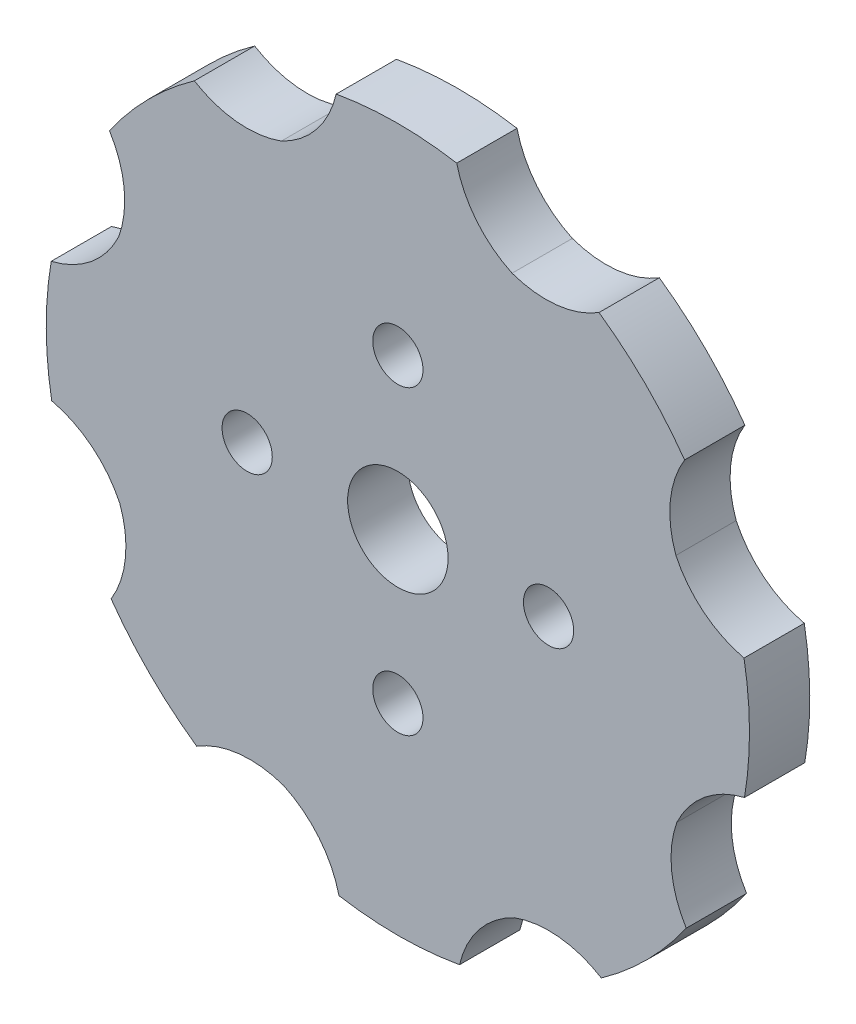
ISO-10303-21;
HEADER;
FILE_DESCRIPTION(('STEP AP214'),'2;1');
FILE_NAME('part.step','',(''),(''),'','','');
FILE_SCHEMA(('AUTOMOTIVE_DESIGN { 1 0 10303 214 1 1 1 1 }'));
ENDSEC;
DATA;
#1=APPLICATION_CONTEXT('core data for automotive mechanical design processes');
#2=APPLICATION_PROTOCOL_DEFINITION('international standard','automotive_design',2000,#1);
#3=PRODUCT_CONTEXT('',#1,'mechanical');
#4=PRODUCT('Part','Part','',(#3));
#5=PRODUCT_RELATED_PRODUCT_CATEGORY('part','',(#4));
#6=PRODUCT_DEFINITION_FORMATION('','',#4);
#7=PRODUCT_DEFINITION_CONTEXT('part definition',#1,'design');
#8=PRODUCT_DEFINITION('design','',#6,#7);
#9=PRODUCT_DEFINITION_SHAPE('','',#8);
#10=(LENGTH_UNIT() NAMED_UNIT(*) SI_UNIT(.MILLI.,.METRE.));
#11=(NAMED_UNIT(*) PLANE_ANGLE_UNIT() SI_UNIT($,.RADIAN.));
#12=(NAMED_UNIT(*) SI_UNIT($,.STERADIAN.) SOLID_ANGLE_UNIT());
#13=UNCERTAINTY_MEASURE_WITH_UNIT(LENGTH_MEASURE(1.E-05),#10,'distance_accuracy_value','');
#14=(GEOMETRIC_REPRESENTATION_CONTEXT(3) GLOBAL_UNCERTAINTY_ASSIGNED_CONTEXT((#13)) GLOBAL_UNIT_ASSIGNED_CONTEXT((#10,
#11,#12)) REPRESENTATION_CONTEXT('',''));
#15=CARTESIAN_POINT('',(0.,0.,0.));
#16=DIRECTION('',(0.,0.,1.));
#17=DIRECTION('',(1.,0.,0.));
#18=AXIS2_PLACEMENT_3D('',#15,#16,#17);
#19=CARTESIAN_POINT('',(0.,0.,6.));
#20=DIRECTION('',(0.,0.,1.));
#21=DIRECTION('',(1.,0.,0.));
#22=AXIS2_PLACEMENT_3D('',#19,#20,#21);
#23=PLANE('',#22);
#24=CARTESIAN_POINT('',(8.48977342514678E-13,-15.,6.));
#25=DIRECTION('',(0.,0.,1.));
#26=DIRECTION('',(1.,0.,0.));
#27=AXIS2_PLACEMENT_3D('',#24,#25,#26);
#28=CIRCLE('',#27,2.50000000000091);
#29=CARTESIAN_POINT('',(2.50000000000176,-15.,6.));
#30=VERTEX_POINT('',#29);
#31=EDGE_CURVE('E404',#30,#30,#28,.T.);
#32=ORIENTED_EDGE('',*,*,#31,.F.);
#33=EDGE_LOOP('',(#32));
#34=FACE_BOUND('',#33,.T.);
#35=CARTESIAN_POINT('',(0.,0.,6.));
#36=DIRECTION('',(0.,0.,1.));
#37=DIRECTION('',(1.,0.,0.));
#38=AXIS2_PLACEMENT_3D('',#35,#36,#37);
#39=CIRCLE('',#38,5.);
#40=CARTESIAN_POINT('',(5.,0.,6.));
#41=VERTEX_POINT('',#40);
#42=EDGE_CURVE('E392',#41,#41,#39,.T.);
#43=ORIENTED_EDGE('',*,*,#42,.F.);
#44=EDGE_LOOP('',(#43));
#45=FACE_BOUND('',#44,.T.);
#46=CARTESIAN_POINT('',(0.,0.,6.));
#47=DIRECTION('',(0.,0.,1.));
#48=DIRECTION('',(1.,0.,0.));
#49=AXIS2_PLACEMENT_3D('',#46,#47,#48);
#50=CIRCLE('',#49,35.);
#51=CARTESIAN_POINT('',(5.85964823646491,34.5060070501484,6.));
#52=VERTEX_POINT('',#51);
#53=CARTESIAN_POINT('',(-6.14042120255465,34.4571505997698,6.));
#54=VERTEX_POINT('',#53);
#55=EDGE_CURVE('E194',#52,#54,#50,.T.);
#56=ORIENTED_EDGE('',*,*,#55,.T.);
#57=CARTESIAN_POINT('',(-15.8830175623136,36.7114389954308,6.));
#58=DIRECTION('',(0.,0.,1.));
#59=DIRECTION('',(1.,0.,0.));
#60=AXIS2_PLACEMENT_3D('',#57,#58,#59);
#61=CIRCLE('',#60,10.);
#62=CARTESIAN_POINT('',(-11.5963492171212,27.6768125782332,6.));
#63=VERTEX_POINT('',#62);
#64=EDGE_CURVE('E11',#54,#63,#61,.F.);
#65=ORIENTED_EDGE('',*,*,#64,.T.);
#66=CARTESIAN_POINT('',(-15.0302507422256,37.068741044522,6.));
#67=DIRECTION('',(0.,0.,1.));
#68=DIRECTION('',(1.,0.,0.));
#69=AXIS2_PLACEMENT_3D('',#66,#67,#68);
#70=CIRCLE('',#69,10.);
#71=CARTESIAN_POINT('',(-20.2560345734583,28.5428285802032,6.));
#72=VERTEX_POINT('',#71);
#73=EDGE_CURVE('E220',#63,#72,#70,.F.);
#74=ORIENTED_EDGE('',*,*,#73,.T.);
#75=CARTESIAN_POINT('',(0.,0.,6.));
#76=DIRECTION('',(0.,0.,1.));
#77=DIRECTION('',(1.,0.,0.));
#78=AXIS2_PLACEMENT_3D('',#75,#76,#77);
#79=CIRCLE('',#78,35.);
#80=CARTESIAN_POINT('',(-28.7068183211312,20.0229513777957,6.));
#81=VERTEX_POINT('',#80);
#82=EDGE_CURVE('E202',#72,#81,#79,.T.);
#83=ORIENTED_EDGE('',*,*,#82,.T.);
#84=CARTESIAN_POINT('',(-37.1898968848022,14.7279180367689,6.));
#85=DIRECTION('',(0.,0.,1.));
#86=DIRECTION('',(1.,0.,0.));
#87=AXIS2_PLACEMENT_3D('',#84,#85,#86);
#88=CIRCLE('',#87,10.);
#89=CARTESIAN_POINT('',(-27.7703190241314,11.3706046872642,6.));
#90=VERTEX_POINT('',#89);
#91=EDGE_CURVE('E226',#81,#90,#88,.F.);
#92=ORIENTED_EDGE('',*,*,#91,.T.);
#93=CARTESIAN_POINT('',(-36.8395503853915,15.5835659398677,6.));
#94=DIRECTION('',(0.,0.,1.));
#95=DIRECTION('',(1.,0.,0.));
#96=AXIS2_PLACEMENT_3D('',#93,#94,#95);
#97=CIRCLE('',#96,10.);
#98=CARTESIAN_POINT('',(-34.5060070501484,5.85964823646528,6.));
#99=VERTEX_POINT('',#98);
#100=EDGE_CURVE('E256',#90,#99,#97,.F.);
#101=ORIENTED_EDGE('',*,*,#100,.T.);
#102=CARTESIAN_POINT('',(0.,0.,6.));
#103=DIRECTION('',(0.,0.,1.));
#104=DIRECTION('',(1.,0.,0.));
#105=AXIS2_PLACEMENT_3D('',#102,#103,#104);
#106=CIRCLE('',#105,35.);
#107=CARTESIAN_POINT('',(-34.4571505997699,-6.14042120255429,6.));
#108=VERTEX_POINT('',#107);
#109=EDGE_CURVE('E386',#99,#108,#106,.T.);
#110=ORIENTED_EDGE('',*,*,#109,.T.);
#111=CARTESIAN_POINT('',(-36.711438995431,-15.8830175623132,6.));
#112=DIRECTION('',(0.,0.,1.));
#113=DIRECTION('',(1.,0.,0.));
#114=AXIS2_PLACEMENT_3D('',#111,#112,#113);
#115=CIRCLE('',#114,10.);
#116=CARTESIAN_POINT('',(-27.6768125782332,-11.5963492171212,6.));
#117=VERTEX_POINT('',#116);
#118=EDGE_CURVE('E270',#108,#117,#115,.F.);
#119=ORIENTED_EDGE('',*,*,#118,.T.);
#120=CARTESIAN_POINT('',(-37.0687410445219,-15.0302507422257,6.));
#121=DIRECTION('',(0.,0.,1.));
#122=DIRECTION('',(1.,0.,0.));
#123=AXIS2_PLACEMENT_3D('',#120,#121,#122);
#124=CIRCLE('',#123,10.);
#125=CARTESIAN_POINT('',(-28.5428285802031,-20.2560345734584,6.));
#126=VERTEX_POINT('',#125);
#127=EDGE_CURVE('E274',#117,#126,#124,.F.);
#128=ORIENTED_EDGE('',*,*,#127,.T.);
#129=CARTESIAN_POINT('',(0.,0.,6.));
#130=DIRECTION('',(0.,0.,1.));
#131=DIRECTION('',(1.,0.,0.));
#132=AXIS2_PLACEMENT_3D('',#129,#130,#131);
#133=CIRCLE('',#132,35.);
#134=CARTESIAN_POINT('',(-20.0229513777956,-28.7068183211312,6.));
#135=VERTEX_POINT('',#134);
#136=EDGE_CURVE('E384',#126,#135,#133,.T.);
#137=ORIENTED_EDGE('',*,*,#136,.T.);
#138=CARTESIAN_POINT('',(-14.7279180367687,-37.1898968848022,6.));
#139=DIRECTION('',(0.,0.,1.));
#140=DIRECTION('',(1.,0.,0.));
#141=AXIS2_PLACEMENT_3D('',#138,#139,#140);
#142=CIRCLE('',#141,10.);
#143=CARTESIAN_POINT('',(-11.3706046872641,-27.7703190241315,6.));
#144=VERTEX_POINT('',#143);
#145=EDGE_CURVE('E278',#135,#144,#142,.F.);
#146=ORIENTED_EDGE('',*,*,#145,.T.);
#147=CARTESIAN_POINT('',(-15.5835659398675,-36.8395503853915,6.));
#148=DIRECTION('',(0.,0.,1.));
#149=DIRECTION('',(1.,0.,0.));
#150=AXIS2_PLACEMENT_3D('',#147,#148,#149);
#151=CIRCLE('',#150,10.);
#152=CARTESIAN_POINT('',(-5.85964823646518,-34.5060070501484,6.));
#153=VERTEX_POINT('',#152);
#154=EDGE_CURVE('E282',#144,#153,#151,.F.);
#155=ORIENTED_EDGE('',*,*,#154,.T.);
#156=CARTESIAN_POINT('',(0.,0.,6.));
#157=DIRECTION('',(0.,0.,1.));
#158=DIRECTION('',(1.,0.,0.));
#159=AXIS2_PLACEMENT_3D('',#156,#157,#158);
#160=CIRCLE('',#159,35.);
#161=CARTESIAN_POINT('',(6.14042120255441,-34.4571505997699,6.));
#162=VERTEX_POINT('',#161);
#163=EDGE_CURVE('E382',#153,#162,#160,.T.);
#164=ORIENTED_EDGE('',*,*,#163,.T.);
#165=CARTESIAN_POINT('',(15.8830175623133,-36.7114389954309,6.));
#166=DIRECTION('',(0.,0.,1.));
#167=DIRECTION('',(1.,0.,0.));
#168=AXIS2_PLACEMENT_3D('',#165,#166,#167);
#169=CIRCLE('',#168,10.);
#170=CARTESIAN_POINT('',(11.5963492171211,-27.6768125782332,6.));
#171=VERTEX_POINT('',#170);
#172=EDGE_CURVE('E286',#162,#171,#169,.F.);
#173=ORIENTED_EDGE('',*,*,#172,.T.);
#174=CARTESIAN_POINT('',(15.0302507422258,-37.0687410445219,6.));
#175=DIRECTION('',(0.,0.,1.));
#176=DIRECTION('',(1.,0.,0.));
#177=AXIS2_PLACEMENT_3D('',#174,#175,#176);
#178=CIRCLE('',#177,10.);
#179=CARTESIAN_POINT('',(20.2560345734585,-28.542828580203,6.));
#180=VERTEX_POINT('',#179);
#181=EDGE_CURVE('E290',#171,#180,#178,.F.);
#182=ORIENTED_EDGE('',*,*,#181,.T.);
#183=CARTESIAN_POINT('',(0.,0.,6.));
#184=DIRECTION('',(0.,0.,1.));
#185=DIRECTION('',(1.,0.,0.));
#186=AXIS2_PLACEMENT_3D('',#183,#184,#185);
#187=CIRCLE('',#186,35.);
#188=CARTESIAN_POINT('',(28.7068183211313,-20.0229513777955,6.));
#189=VERTEX_POINT('',#188);
#190=EDGE_CURVE('E380',#180,#189,#187,.T.);
#191=ORIENTED_EDGE('',*,*,#190,.T.);
#192=CARTESIAN_POINT('',(37.1898968848023,-14.7279180367686,6.));
#193=DIRECTION('',(0.,0.,1.));
#194=DIRECTION('',(1.,0.,0.));
#195=AXIS2_PLACEMENT_3D('',#192,#193,#194);
#196=CIRCLE('',#195,10.);
#197=CARTESIAN_POINT('',(27.7703190241316,-11.370604687264,6.));
#198=VERTEX_POINT('',#197);
#199=EDGE_CURVE('E294',#189,#198,#196,.F.);
#200=ORIENTED_EDGE('',*,*,#199,.T.);
#201=CARTESIAN_POINT('',(36.8395503853916,-15.5835659398674,6.));
#202=DIRECTION('',(0.,0.,1.));
#203=DIRECTION('',(1.,0.,0.));
#204=AXIS2_PLACEMENT_3D('',#201,#202,#203);
#205=CIRCLE('',#204,10.);
#206=CARTESIAN_POINT('',(34.5060070501484,-5.85964823646506,6.));
#207=VERTEX_POINT('',#206);
#208=EDGE_CURVE('E298',#198,#207,#205,.F.);
#209=ORIENTED_EDGE('',*,*,#208,.T.);
#210=CARTESIAN_POINT('',(0.,0.,6.));
#211=DIRECTION('',(0.,0.,1.));
#212=DIRECTION('',(1.,0.,0.));
#213=AXIS2_PLACEMENT_3D('',#210,#211,#212);
#214=CIRCLE('',#213,35.);
#215=CARTESIAN_POINT('',(34.4571505997698,6.14042120255453,6.));
#216=VERTEX_POINT('',#215);
#217=EDGE_CURVE('E378',#207,#216,#214,.T.);
#218=ORIENTED_EDGE('',*,*,#217,.T.);
#219=CARTESIAN_POINT('',(36.7114389954308,15.8830175623135,6.));
#220=DIRECTION('',(0.,0.,1.));
#221=DIRECTION('',(1.,0.,0.));
#222=AXIS2_PLACEMENT_3D('',#219,#220,#221);
#223=CIRCLE('',#222,10.);
#224=CARTESIAN_POINT('',(27.6768125782331,11.5963492171213,6.));
#225=VERTEX_POINT('',#224);
#226=EDGE_CURVE('E302',#216,#225,#223,.F.);
#227=ORIENTED_EDGE('',*,*,#226,.T.);
#228=CARTESIAN_POINT('',(37.0687410445218,15.030250742226,6.));
#229=DIRECTION('',(0.,0.,1.));
#230=DIRECTION('',(1.,0.,0.));
#231=AXIS2_PLACEMENT_3D('',#228,#229,#230);
#232=CIRCLE('',#231,10.);
#233=CARTESIAN_POINT('',(28.542828580203,20.2560345734586,6.));
#234=VERTEX_POINT('',#233);
#235=EDGE_CURVE('E306',#225,#234,#232,.F.);
#236=ORIENTED_EDGE('',*,*,#235,.T.);
#237=CARTESIAN_POINT('',(0.,0.,6.));
#238=DIRECTION('',(0.,0.,1.));
#239=DIRECTION('',(1.,0.,0.));
#240=AXIS2_PLACEMENT_3D('',#237,#238,#239);
#241=CIRCLE('',#240,35.);
#242=CARTESIAN_POINT('',(20.0229513777954,28.7068183211314,6.));
#243=VERTEX_POINT('',#242);
#244=EDGE_CURVE('E355',#234,#243,#241,.T.);
#245=ORIENTED_EDGE('',*,*,#244,.T.);
#246=CARTESIAN_POINT('',(14.7279180367684,37.1898968848023,6.));
#247=DIRECTION('',(0.,0.,1.));
#248=DIRECTION('',(1.,0.,0.));
#249=AXIS2_PLACEMENT_3D('',#246,#247,#248);
#250=CIRCLE('',#249,10.);
#251=CARTESIAN_POINT('',(11.3706046872639,27.7703190241316,6.));
#252=VERTEX_POINT('',#251);
#253=EDGE_CURVE('E310',#243,#252,#250,.F.);
#254=ORIENTED_EDGE('',*,*,#253,.T.);
#255=CARTESIAN_POINT('',(15.5835659398673,36.8395503853916,6.));
#256=DIRECTION('',(0.,0.,1.));
#257=DIRECTION('',(1.,0.,0.));
#258=AXIS2_PLACEMENT_3D('',#255,#256,#257);
#259=CIRCLE('',#258,10.);
#260=EDGE_CURVE('E198',#252,#52,#259,.F.);
#261=ORIENTED_EDGE('',*,*,#260,.T.);
#262=EDGE_LOOP('',(#56,#65,#74,#83,#92,#101,#110,#119,#128,#137,#146,#155,#164,#173,#182,#191,
#200,#209,#218,#227,#236,#245,#254,#261));
#263=FACE_BOUND('',#262,.T.);
#264=CARTESIAN_POINT('',(0.,15.,6.));
#265=DIRECTION('',(0.,0.,1.));
#266=DIRECTION('',(1.,0.,0.));
#267=AXIS2_PLACEMENT_3D('',#264,#265,#266);
#268=CIRCLE('',#267,2.5);
#269=CARTESIAN_POINT('',(2.5,15.,6.));
#270=VERTEX_POINT('',#269);
#271=EDGE_CURVE('E376',#270,#270,#268,.T.);
#272=ORIENTED_EDGE('',*,*,#271,.F.);
#273=EDGE_LOOP('',(#272));
#274=FACE_BOUND('',#273,.T.);
#275=CARTESIAN_POINT('',(15.,0.,6.));
#276=DIRECTION('',(0.,0.,1.));
#277=DIRECTION('',(1.,0.,0.));
#278=AXIS2_PLACEMENT_3D('',#275,#276,#277);
#279=CIRCLE('',#278,2.5);
#280=CARTESIAN_POINT('',(17.5,0.,6.));
#281=VERTEX_POINT('',#280);
#282=EDGE_CURVE('E398',#281,#281,#279,.T.);
#283=ORIENTED_EDGE('',*,*,#282,.F.);
#284=EDGE_LOOP('',(#283));
#285=FACE_BOUND('',#284,.T.);
#286=CARTESIAN_POINT('',(-15.,1.57116660247941E-13,6.));
#287=DIRECTION('',(0.,0.,1.));
#288=DIRECTION('',(1.,0.,0.));
#289=AXIS2_PLACEMENT_3D('',#286,#287,#288);
#290=CIRCLE('',#289,2.5);
#291=CARTESIAN_POINT('',(-12.5,1.57116660247941E-13,6.));
#292=VERTEX_POINT('',#291);
#293=EDGE_CURVE('E410',#292,#292,#290,.T.);
#294=ORIENTED_EDGE('',*,*,#293,.F.);
#295=EDGE_LOOP('',(#294));
#296=FACE_BOUND('',#295,.T.);
#297=ADVANCED_FACE('F35',(#34,#45,#263,#274,#285,#296),#23,.T.);
#298=CARTESIAN_POINT('',(0.,0.,0.));
#299=DIRECTION('',(0.,0.,1.));
#300=DIRECTION('',(1.,0.,0.));
#301=AXIS2_PLACEMENT_3D('',#298,#299,#300);
#302=PLANE('',#301);
#303=CARTESIAN_POINT('',(0.,0.,0.));
#304=DIRECTION('',(0.,0.,1.));
#305=DIRECTION('',(1.,0.,0.));
#306=AXIS2_PLACEMENT_3D('',#303,#304,#305);
#307=CIRCLE('',#306,35.);
#308=CARTESIAN_POINT('',(5.85964823646491,34.5060070501484,0.));
#309=VERTEX_POINT('',#308);
#310=CARTESIAN_POINT('',(-6.14042120255465,34.4571505997698,0.));
#311=VERTEX_POINT('',#310);
#312=EDGE_CURVE('E210',#309,#311,#307,.T.);
#313=ORIENTED_EDGE('',*,*,#312,.F.);
#314=CARTESIAN_POINT('',(15.5835659398673,36.8395503853916,0.));
#315=DIRECTION('',(0.,0.,1.));
#316=DIRECTION('',(1.,0.,0.));
#317=AXIS2_PLACEMENT_3D('',#314,#315,#316);
#318=CIRCLE('',#317,10.);
#319=CARTESIAN_POINT('',(11.3706046872639,27.7703190241316,0.));
#320=VERTEX_POINT('',#319);
#321=EDGE_CURVE('E212',#309,#320,#318,.T.);
#322=ORIENTED_EDGE('',*,*,#321,.T.);
#323=CARTESIAN_POINT('',(14.7279180367684,37.1898968848023,0.));
#324=DIRECTION('',(0.,0.,1.));
#325=DIRECTION('',(1.,0.,0.));
#326=AXIS2_PLACEMENT_3D('',#323,#324,#325);
#327=CIRCLE('',#326,10.);
#328=CARTESIAN_POINT('',(20.0229513777954,28.7068183211314,0.));
#329=VERTEX_POINT('',#328);
#330=EDGE_CURVE('E312',#320,#329,#327,.T.);
#331=ORIENTED_EDGE('',*,*,#330,.T.);
#332=CARTESIAN_POINT('',(0.,0.,0.));
#333=DIRECTION('',(0.,0.,1.));
#334=DIRECTION('',(1.,0.,0.));
#335=AXIS2_PLACEMENT_3D('',#332,#333,#334);
#336=CIRCLE('',#335,35.);
#337=CARTESIAN_POINT('',(28.542828580203,20.2560345734586,0.));
#338=VERTEX_POINT('',#337);
#339=EDGE_CURVE('E203',#338,#329,#336,.T.);
#340=ORIENTED_EDGE('',*,*,#339,.F.);
#341=CARTESIAN_POINT('',(37.0687410445218,15.030250742226,0.));
#342=DIRECTION('',(0.,0.,1.));
#343=DIRECTION('',(1.,0.,0.));
#344=AXIS2_PLACEMENT_3D('',#341,#342,#343);
#345=CIRCLE('',#344,10.);
#346=CARTESIAN_POINT('',(27.6768125782331,11.5963492171213,0.));
#347=VERTEX_POINT('',#346);
#348=EDGE_CURVE('E308',#338,#347,#345,.T.);
#349=ORIENTED_EDGE('',*,*,#348,.T.);
#350=CARTESIAN_POINT('',(36.7114389954308,15.8830175623135,0.));
#351=DIRECTION('',(0.,0.,1.));
#352=DIRECTION('',(1.,0.,0.));
#353=AXIS2_PLACEMENT_3D('',#350,#351,#352);
#354=CIRCLE('',#353,10.);
#355=CARTESIAN_POINT('',(34.4571505997698,6.14042120255453,0.));
#356=VERTEX_POINT('',#355);
#357=EDGE_CURVE('E304',#347,#356,#354,.T.);
#358=ORIENTED_EDGE('',*,*,#357,.T.);
#359=CARTESIAN_POINT('',(0.,0.,0.));
#360=DIRECTION('',(0.,0.,1.));
#361=DIRECTION('',(1.,0.,0.));
#362=AXIS2_PLACEMENT_3D('',#359,#360,#361);
#363=CIRCLE('',#362,35.);
#364=CARTESIAN_POINT('',(34.5060070501484,-5.85964823646506,0.));
#365=VERTEX_POINT('',#364);
#366=EDGE_CURVE('E358',#365,#356,#363,.T.);
#367=ORIENTED_EDGE('',*,*,#366,.F.);
#368=CARTESIAN_POINT('',(36.8395503853916,-15.5835659398674,0.));
#369=DIRECTION('',(0.,0.,1.));
#370=DIRECTION('',(1.,0.,0.));
#371=AXIS2_PLACEMENT_3D('',#368,#369,#370);
#372=CIRCLE('',#371,10.);
#373=CARTESIAN_POINT('',(27.7703190241316,-11.370604687264,0.));
#374=VERTEX_POINT('',#373);
#375=EDGE_CURVE('E300',#365,#374,#372,.T.);
#376=ORIENTED_EDGE('',*,*,#375,.T.);
#377=CARTESIAN_POINT('',(37.1898968848023,-14.7279180367686,0.));
#378=DIRECTION('',(0.,0.,1.));
#379=DIRECTION('',(1.,0.,0.));
#380=AXIS2_PLACEMENT_3D('',#377,#378,#379);
#381=CIRCLE('',#380,10.);
#382=CARTESIAN_POINT('',(28.7068183211313,-20.0229513777955,0.));
#383=VERTEX_POINT('',#382);
#384=EDGE_CURVE('E296',#374,#383,#381,.T.);
#385=ORIENTED_EDGE('',*,*,#384,.T.);
#386=CARTESIAN_POINT('',(0.,0.,0.));
#387=DIRECTION('',(0.,0.,1.));
#388=DIRECTION('',(1.,0.,0.));
#389=AXIS2_PLACEMENT_3D('',#386,#387,#388);
#390=CIRCLE('',#389,35.);
#391=CARTESIAN_POINT('',(20.2560345734585,-28.542828580203,0.));
#392=VERTEX_POINT('',#391);
#393=EDGE_CURVE('E361',#392,#383,#390,.T.);
#394=ORIENTED_EDGE('',*,*,#393,.F.);
#395=CARTESIAN_POINT('',(15.0302507422258,-37.0687410445219,0.));
#396=DIRECTION('',(0.,0.,1.));
#397=DIRECTION('',(1.,0.,0.));
#398=AXIS2_PLACEMENT_3D('',#395,#396,#397);
#399=CIRCLE('',#398,10.);
#400=CARTESIAN_POINT('',(11.5963492171211,-27.6768125782332,0.));
#401=VERTEX_POINT('',#400);
#402=EDGE_CURVE('E292',#392,#401,#399,.T.);
#403=ORIENTED_EDGE('',*,*,#402,.T.);
#404=CARTESIAN_POINT('',(15.8830175623133,-36.7114389954309,0.));
#405=DIRECTION('',(0.,0.,1.));
#406=DIRECTION('',(1.,0.,0.));
#407=AXIS2_PLACEMENT_3D('',#404,#405,#406);
#408=CIRCLE('',#407,10.);
#409=CARTESIAN_POINT('',(6.14042120255441,-34.4571505997699,0.));
#410=VERTEX_POINT('',#409);
#411=EDGE_CURVE('E288',#401,#410,#408,.T.);
#412=ORIENTED_EDGE('',*,*,#411,.T.);
#413=CARTESIAN_POINT('',(0.,0.,0.));
#414=DIRECTION('',(0.,0.,1.));
#415=DIRECTION('',(1.,0.,0.));
#416=AXIS2_PLACEMENT_3D('',#413,#414,#415);
#417=CIRCLE('',#416,35.);
#418=CARTESIAN_POINT('',(-5.85964823646518,-34.5060070501484,0.));
#419=VERTEX_POINT('',#418);
#420=EDGE_CURVE('E364',#419,#410,#417,.T.);
#421=ORIENTED_EDGE('',*,*,#420,.F.);
#422=CARTESIAN_POINT('',(-15.5835659398675,-36.8395503853915,0.));
#423=DIRECTION('',(0.,0.,1.));
#424=DIRECTION('',(1.,0.,0.));
#425=AXIS2_PLACEMENT_3D('',#422,#423,#424);
#426=CIRCLE('',#425,10.);
#427=CARTESIAN_POINT('',(-11.3706046872641,-27.7703190241315,0.));
#428=VERTEX_POINT('',#427);
#429=EDGE_CURVE('E284',#419,#428,#426,.T.);
#430=ORIENTED_EDGE('',*,*,#429,.T.);
#431=CARTESIAN_POINT('',(-14.7279180367687,-37.1898968848022,0.));
#432=DIRECTION('',(0.,0.,1.));
#433=DIRECTION('',(1.,0.,0.));
#434=AXIS2_PLACEMENT_3D('',#431,#432,#433);
#435=CIRCLE('',#434,10.);
#436=CARTESIAN_POINT('',(-20.0229513777956,-28.7068183211312,0.));
#437=VERTEX_POINT('',#436);
#438=EDGE_CURVE('E280',#428,#437,#435,.T.);
#439=ORIENTED_EDGE('',*,*,#438,.T.);
#440=CARTESIAN_POINT('',(0.,0.,0.));
#441=DIRECTION('',(0.,0.,1.));
#442=DIRECTION('',(1.,0.,0.));
#443=AXIS2_PLACEMENT_3D('',#440,#441,#442);
#444=CIRCLE('',#443,35.);
#445=CARTESIAN_POINT('',(-28.5428285802031,-20.2560345734584,0.));
#446=VERTEX_POINT('',#445);
#447=EDGE_CURVE('E367',#446,#437,#444,.T.);
#448=ORIENTED_EDGE('',*,*,#447,.F.);
#449=CARTESIAN_POINT('',(-37.0687410445219,-15.0302507422257,0.));
#450=DIRECTION('',(0.,0.,1.));
#451=DIRECTION('',(1.,0.,0.));
#452=AXIS2_PLACEMENT_3D('',#449,#450,#451);
#453=CIRCLE('',#452,10.);
#454=CARTESIAN_POINT('',(-27.6768125782332,-11.5963492171212,0.));
#455=VERTEX_POINT('',#454);
#456=EDGE_CURVE('E276',#446,#455,#453,.T.);
#457=ORIENTED_EDGE('',*,*,#456,.T.);
#458=CARTESIAN_POINT('',(-36.711438995431,-15.8830175623132,0.));
#459=DIRECTION('',(0.,0.,1.));
#460=DIRECTION('',(1.,0.,0.));
#461=AXIS2_PLACEMENT_3D('',#458,#459,#460);
#462=CIRCLE('',#461,10.);
#463=CARTESIAN_POINT('',(-34.4571505997699,-6.14042120255429,0.));
#464=VERTEX_POINT('',#463);
#465=EDGE_CURVE('E272',#455,#464,#462,.T.);
#466=ORIENTED_EDGE('',*,*,#465,.T.);
#467=CARTESIAN_POINT('',(0.,0.,0.));
#468=DIRECTION('',(0.,0.,1.));
#469=DIRECTION('',(1.,0.,0.));
#470=AXIS2_PLACEMENT_3D('',#467,#468,#469);
#471=CIRCLE('',#470,35.);
#472=CARTESIAN_POINT('',(-34.5060070501484,5.85964823646528,0.));
#473=VERTEX_POINT('',#472);
#474=EDGE_CURVE('E370',#473,#464,#471,.T.);
#475=ORIENTED_EDGE('',*,*,#474,.F.);
#476=CARTESIAN_POINT('',(-36.8395503853915,15.5835659398677,0.));
#477=DIRECTION('',(0.,0.,1.));
#478=DIRECTION('',(1.,0.,0.));
#479=AXIS2_PLACEMENT_3D('',#476,#477,#478);
#480=CIRCLE('',#479,10.);
#481=CARTESIAN_POINT('',(-27.7703190241314,11.3706046872642,0.));
#482=VERTEX_POINT('',#481);
#483=EDGE_CURVE('E254',#473,#482,#480,.T.);
#484=ORIENTED_EDGE('',*,*,#483,.T.);
#485=CARTESIAN_POINT('',(-37.1898968848022,14.7279180367689,0.));
#486=DIRECTION('',(0.,0.,1.));
#487=DIRECTION('',(1.,0.,0.));
#488=AXIS2_PLACEMENT_3D('',#485,#486,#487);
#489=CIRCLE('',#488,10.);
#490=CARTESIAN_POINT('',(-28.7068183211312,20.0229513777957,0.));
#491=VERTEX_POINT('',#490);
#492=EDGE_CURVE('E262',#482,#491,#489,.T.);
#493=ORIENTED_EDGE('',*,*,#492,.T.);
#494=CARTESIAN_POINT('',(0.,0.,0.));
#495=DIRECTION('',(0.,0.,1.));
#496=DIRECTION('',(1.,0.,0.));
#497=AXIS2_PLACEMENT_3D('',#494,#495,#496);
#498=CIRCLE('',#497,35.);
#499=CARTESIAN_POINT('',(-20.2560345734583,28.5428285802032,0.));
#500=VERTEX_POINT('',#499);
#501=EDGE_CURVE('E373',#500,#491,#498,.T.);
#502=ORIENTED_EDGE('',*,*,#501,.F.);
#503=CARTESIAN_POINT('',(-15.0302507422256,37.068741044522,0.));
#504=DIRECTION('',(0.,0.,1.));
#505=DIRECTION('',(1.,0.,0.));
#506=AXIS2_PLACEMENT_3D('',#503,#504,#505);
#507=CIRCLE('',#506,10.);
#508=CARTESIAN_POINT('',(-11.5963492171212,27.6768125782332,0.));
#509=VERTEX_POINT('',#508);
#510=EDGE_CURVE('E58',#500,#509,#507,.T.);
#511=ORIENTED_EDGE('',*,*,#510,.T.);
#512=CARTESIAN_POINT('',(-15.8830175623136,36.7114389954308,0.));
#513=DIRECTION('',(0.,0.,1.));
#514=DIRECTION('',(1.,0.,0.));
#515=AXIS2_PLACEMENT_3D('',#512,#513,#514);
#516=CIRCLE('',#515,10.);
#517=EDGE_CURVE('E44',#509,#311,#516,.T.);
#518=ORIENTED_EDGE('',*,*,#517,.T.);
#519=EDGE_LOOP('',(#313,#322,#331,#340,#349,#358,#367,#376,#385,#394,#403,#412,#421,#430,#439,
#448,#457,#466,#475,#484,#493,#502,#511,#518));
#520=FACE_BOUND('',#519,.T.);
#521=CARTESIAN_POINT('',(0.,15.,0.));
#522=DIRECTION('',(0.,0.,1.));
#523=DIRECTION('',(1.,0.,0.));
#524=AXIS2_PLACEMENT_3D('',#521,#522,#523);
#525=CIRCLE('',#524,2.5);
#526=CARTESIAN_POINT('',(2.5,15.,0.));
#527=VERTEX_POINT('',#526);
#528=EDGE_CURVE('E389',#527,#527,#525,.T.);
#529=ORIENTED_EDGE('',*,*,#528,.T.);
#530=EDGE_LOOP('',(#529));
#531=FACE_BOUND('',#530,.T.);
#532=CARTESIAN_POINT('',(0.,0.,0.));
#533=DIRECTION('',(0.,0.,1.));
#534=DIRECTION('',(1.,0.,0.));
#535=AXIS2_PLACEMENT_3D('',#532,#533,#534);
#536=CIRCLE('',#535,5.);
#537=CARTESIAN_POINT('',(5.,0.,0.));
#538=VERTEX_POINT('',#537);
#539=EDGE_CURVE('E395',#538,#538,#536,.T.);
#540=ORIENTED_EDGE('',*,*,#539,.T.);
#541=EDGE_LOOP('',(#540));
#542=FACE_BOUND('',#541,.T.);
#543=CARTESIAN_POINT('',(15.,0.,0.));
#544=DIRECTION('',(0.,0.,1.));
#545=DIRECTION('',(1.,0.,0.));
#546=AXIS2_PLACEMENT_3D('',#543,#544,#545);
#547=CIRCLE('',#546,2.5);
#548=CARTESIAN_POINT('',(17.5,0.,0.));
#549=VERTEX_POINT('',#548);
#550=EDGE_CURVE('E401',#549,#549,#547,.T.);
#551=ORIENTED_EDGE('',*,*,#550,.T.);
#552=EDGE_LOOP('',(#551));
#553=FACE_BOUND('',#552,.T.);
#554=CARTESIAN_POINT('',(8.48977342514678E-13,-15.,0.));
#555=DIRECTION('',(0.,0.,1.));
#556=DIRECTION('',(1.,0.,0.));
#557=AXIS2_PLACEMENT_3D('',#554,#555,#556);
#558=CIRCLE('',#557,2.50000000000091);
#559=CARTESIAN_POINT('',(2.50000000000176,-15.,0.));
#560=VERTEX_POINT('',#559);
#561=EDGE_CURVE('E407',#560,#560,#558,.T.);
#562=ORIENTED_EDGE('',*,*,#561,.T.);
#563=EDGE_LOOP('',(#562));
#564=FACE_BOUND('',#563,.T.);
#565=CARTESIAN_POINT('',(-15.,1.57116660247941E-13,0.));
#566=DIRECTION('',(0.,0.,1.));
#567=DIRECTION('',(1.,0.,0.));
#568=AXIS2_PLACEMENT_3D('',#565,#566,#567);
#569=CIRCLE('',#568,2.5);
#570=CARTESIAN_POINT('',(-12.5,1.57116660247941E-13,0.));
#571=VERTEX_POINT('',#570);
#572=EDGE_CURVE('E233',#571,#571,#569,.T.);
#573=ORIENTED_EDGE('',*,*,#572,.T.);
#574=EDGE_LOOP('',(#573));
#575=FACE_BOUND('',#574,.T.);
#576=ADVANCED_FACE('F422',(#520,#531,#542,#553,#564,#575),#302,.F.);
#577=CARTESIAN_POINT('',(0.,0.,6.));
#578=DIRECTION('',(0.,0.,-1.));
#579=DIRECTION('',(-1.,0.,0.));
#580=AXIS2_PLACEMENT_3D('',#577,#578,#579);
#581=CYLINDRICAL_SURFACE('',#580,35.);
#582=ORIENTED_EDGE('',*,*,#312,.T.);
#583=DIRECTION('',(0.,0.,-1.));
#584=VECTOR('',#583,1.);
#585=CARTESIAN_POINT('',(-6.14042120255465,34.4571505997698,6.));
#586=LINE('',#585,#584);
#587=EDGE_CURVE('E207',#54,#311,#586,.T.);
#588=ORIENTED_EDGE('',*,*,#587,.F.);
#589=ORIENTED_EDGE('',*,*,#55,.F.);
#590=DIRECTION('',(0.,0.,-1.));
#591=VECTOR('',#590,1.);
#592=CARTESIAN_POINT('',(5.85964823646491,34.5060070501484,6.));
#593=LINE('',#592,#591);
#594=EDGE_CURVE('E353',#52,#309,#593,.T.);
#595=ORIENTED_EDGE('',*,*,#594,.T.);
#596=EDGE_LOOP('',(#582,#588,#589,#595));
#597=FACE_BOUND('',#596,.T.);
#598=ADVANCED_FACE('F208',(#597),#581,.T.);
#599=CARTESIAN_POINT('',(0.,0.,6.));
#600=DIRECTION('',(0.,0.,-1.));
#601=DIRECTION('',(-1.,0.,0.));
#602=AXIS2_PLACEMENT_3D('',#599,#600,#601);
#603=CYLINDRICAL_SURFACE('',#602,35.);
#604=ORIENTED_EDGE('',*,*,#501,.T.);
#605=DIRECTION('',(0.,0.,-1.));
#606=VECTOR('',#605,1.);
#607=CARTESIAN_POINT('',(-28.7068183211312,20.0229513777957,6.));
#608=LINE('',#607,#606);
#609=EDGE_CURVE('E264',#81,#491,#608,.T.);
#610=ORIENTED_EDGE('',*,*,#609,.F.);
#611=ORIENTED_EDGE('',*,*,#82,.F.);
#612=DIRECTION('',(0.,0.,-1.));
#613=VECTOR('',#612,1.);
#614=CARTESIAN_POINT('',(-20.2560345734583,28.5428285802032,6.));
#615=LINE('',#614,#613);
#616=EDGE_CURVE('E213',#72,#500,#615,.T.);
#617=ORIENTED_EDGE('',*,*,#616,.T.);
#618=EDGE_LOOP('',(#604,#610,#611,#617));
#619=FACE_BOUND('',#618,.T.);
#620=ADVANCED_FACE('F458',(#619),#603,.T.);
#621=CARTESIAN_POINT('',(0.,0.,6.));
#622=DIRECTION('',(0.,0.,-1.));
#623=DIRECTION('',(-1.,0.,0.));
#624=AXIS2_PLACEMENT_3D('',#621,#622,#623);
#625=CYLINDRICAL_SURFACE('',#624,35.);
#626=ORIENTED_EDGE('',*,*,#474,.T.);
#627=DIRECTION('',(0.,0.,-1.));
#628=VECTOR('',#627,1.);
#629=CARTESIAN_POINT('',(-34.4571505997699,-6.14042120255429,6.));
#630=LINE('',#629,#628);
#631=EDGE_CURVE('E320',#108,#464,#630,.T.);
#632=ORIENTED_EDGE('',*,*,#631,.F.);
#633=ORIENTED_EDGE('',*,*,#109,.F.);
#634=DIRECTION('',(0.,0.,-1.));
#635=VECTOR('',#634,1.);
#636=CARTESIAN_POINT('',(-34.5060070501484,5.85964823646528,6.));
#637=LINE('',#636,#635);
#638=EDGE_CURVE('E318',#99,#473,#637,.T.);
#639=ORIENTED_EDGE('',*,*,#638,.T.);
#640=EDGE_LOOP('',(#626,#632,#633,#639));
#641=FACE_BOUND('',#640,.T.);
#642=ADVANCED_FACE('F454',(#641),#625,.T.);
#643=CARTESIAN_POINT('',(0.,0.,6.));
#644=DIRECTION('',(0.,0.,-1.));
#645=DIRECTION('',(-1.,0.,0.));
#646=AXIS2_PLACEMENT_3D('',#643,#644,#645);
#647=CYLINDRICAL_SURFACE('',#646,35.);
#648=ORIENTED_EDGE('',*,*,#447,.T.);
#649=DIRECTION('',(0.,0.,-1.));
#650=VECTOR('',#649,1.);
#651=CARTESIAN_POINT('',(-20.0229513777956,-28.7068183211312,6.));
#652=LINE('',#651,#650);
#653=EDGE_CURVE('E326',#135,#437,#652,.T.);
#654=ORIENTED_EDGE('',*,*,#653,.F.);
#655=ORIENTED_EDGE('',*,*,#136,.F.);
#656=DIRECTION('',(0.,0.,-1.));
#657=VECTOR('',#656,1.);
#658=CARTESIAN_POINT('',(-28.5428285802031,-20.2560345734584,6.));
#659=LINE('',#658,#657);
#660=EDGE_CURVE('E323',#126,#446,#659,.T.);
#661=ORIENTED_EDGE('',*,*,#660,.T.);
#662=EDGE_LOOP('',(#648,#654,#655,#661));
#663=FACE_BOUND('',#662,.T.);
#664=ADVANCED_FACE('F450',(#663),#647,.T.);
#665=CARTESIAN_POINT('',(0.,0.,6.));
#666=DIRECTION('',(0.,0.,-1.));
#667=DIRECTION('',(-1.,0.,0.));
#668=AXIS2_PLACEMENT_3D('',#665,#666,#667);
#669=CYLINDRICAL_SURFACE('',#668,35.);
#670=ORIENTED_EDGE('',*,*,#420,.T.);
#671=DIRECTION('',(0.,0.,-1.));
#672=VECTOR('',#671,1.);
#673=CARTESIAN_POINT('',(6.14042120255441,-34.4571505997699,6.));
#674=LINE('',#673,#672);
#675=EDGE_CURVE('E332',#162,#410,#674,.T.);
#676=ORIENTED_EDGE('',*,*,#675,.F.);
#677=ORIENTED_EDGE('',*,*,#163,.F.);
#678=DIRECTION('',(0.,0.,-1.));
#679=VECTOR('',#678,1.);
#680=CARTESIAN_POINT('',(-5.85964823646518,-34.5060070501484,6.));
#681=LINE('',#680,#679);
#682=EDGE_CURVE('E329',#153,#419,#681,.T.);
#683=ORIENTED_EDGE('',*,*,#682,.T.);
#684=EDGE_LOOP('',(#670,#676,#677,#683));
#685=FACE_BOUND('',#684,.T.);
#686=ADVANCED_FACE('F446',(#685),#669,.T.);
#687=CARTESIAN_POINT('',(0.,0.,6.));
#688=DIRECTION('',(0.,0.,-1.));
#689=DIRECTION('',(-1.,0.,0.));
#690=AXIS2_PLACEMENT_3D('',#687,#688,#689);
#691=CYLINDRICAL_SURFACE('',#690,35.);
#692=ORIENTED_EDGE('',*,*,#393,.T.);
#693=DIRECTION('',(0.,0.,-1.));
#694=VECTOR('',#693,1.);
#695=CARTESIAN_POINT('',(28.7068183211313,-20.0229513777955,6.));
#696=LINE('',#695,#694);
#697=EDGE_CURVE('E338',#189,#383,#696,.T.);
#698=ORIENTED_EDGE('',*,*,#697,.F.);
#699=ORIENTED_EDGE('',*,*,#190,.F.);
#700=DIRECTION('',(0.,0.,-1.));
#701=VECTOR('',#700,1.);
#702=CARTESIAN_POINT('',(20.2560345734585,-28.542828580203,6.));
#703=LINE('',#702,#701);
#704=EDGE_CURVE('E335',#180,#392,#703,.T.);
#705=ORIENTED_EDGE('',*,*,#704,.T.);
#706=EDGE_LOOP('',(#692,#698,#699,#705));
#707=FACE_BOUND('',#706,.T.);
#708=ADVANCED_FACE('F442',(#707),#691,.T.);
#709=CARTESIAN_POINT('',(0.,0.,6.));
#710=DIRECTION('',(0.,0.,-1.));
#711=DIRECTION('',(-1.,0.,0.));
#712=AXIS2_PLACEMENT_3D('',#709,#710,#711);
#713=CYLINDRICAL_SURFACE('',#712,35.);
#714=ORIENTED_EDGE('',*,*,#366,.T.);
#715=DIRECTION('',(0.,0.,-1.));
#716=VECTOR('',#715,1.);
#717=CARTESIAN_POINT('',(34.4571505997698,6.14042120255453,6.));
#718=LINE('',#717,#716);
#719=EDGE_CURVE('E344',#216,#356,#718,.T.);
#720=ORIENTED_EDGE('',*,*,#719,.F.);
#721=ORIENTED_EDGE('',*,*,#217,.F.);
#722=DIRECTION('',(0.,0.,-1.));
#723=VECTOR('',#722,1.);
#724=CARTESIAN_POINT('',(34.5060070501484,-5.85964823646506,6.));
#725=LINE('',#724,#723);
#726=EDGE_CURVE('E341',#207,#365,#725,.T.);
#727=ORIENTED_EDGE('',*,*,#726,.T.);
#728=EDGE_LOOP('',(#714,#720,#721,#727));
#729=FACE_BOUND('',#728,.T.);
#730=ADVANCED_FACE('F438',(#729),#713,.T.);
#731=CARTESIAN_POINT('',(0.,0.,6.));
#732=DIRECTION('',(0.,0.,-1.));
#733=DIRECTION('',(-1.,0.,0.));
#734=AXIS2_PLACEMENT_3D('',#731,#732,#733);
#735=CYLINDRICAL_SURFACE('',#734,35.);
#736=ORIENTED_EDGE('',*,*,#339,.T.);
#737=DIRECTION('',(0.,0.,-1.));
#738=VECTOR('',#737,1.);
#739=CARTESIAN_POINT('',(20.0229513777954,28.7068183211314,6.));
#740=LINE('',#739,#738);
#741=EDGE_CURVE('E350',#243,#329,#740,.T.);
#742=ORIENTED_EDGE('',*,*,#741,.F.);
#743=ORIENTED_EDGE('',*,*,#244,.F.);
#744=DIRECTION('',(0.,0.,-1.));
#745=VECTOR('',#744,1.);
#746=CARTESIAN_POINT('',(28.542828580203,20.2560345734586,6.));
#747=LINE('',#746,#745);
#748=EDGE_CURVE('E347',#234,#338,#747,.T.);
#749=ORIENTED_EDGE('',*,*,#748,.T.);
#750=EDGE_LOOP('',(#736,#742,#743,#749));
#751=FACE_BOUND('',#750,.T.);
#752=ADVANCED_FACE('F435',(#751),#735,.T.);
#753=CARTESIAN_POINT('',(0.,15.,6.));
#754=DIRECTION('',(0.,0.,-1.));
#755=DIRECTION('',(-1.,0.,0.));
#756=AXIS2_PLACEMENT_3D('',#753,#754,#755);
#757=CYLINDRICAL_SURFACE('',#756,2.5);
#758=ORIENTED_EDGE('',*,*,#271,.T.);
#759=EDGE_LOOP('',(#758));
#760=FACE_BOUND('',#759,.T.);
#761=ORIENTED_EDGE('',*,*,#528,.F.);
#762=EDGE_LOOP('',(#761));
#763=FACE_BOUND('',#762,.T.);
#764=ADVANCED_FACE('F432',(#760,#763),#757,.F.);
#765=CARTESIAN_POINT('',(0.,0.,6.));
#766=DIRECTION('',(0.,0.,-1.));
#767=DIRECTION('',(-1.,0.,0.));
#768=AXIS2_PLACEMENT_3D('',#765,#766,#767);
#769=CYLINDRICAL_SURFACE('',#768,5.);
#770=ORIENTED_EDGE('',*,*,#42,.T.);
#771=EDGE_LOOP('',(#770));
#772=FACE_BOUND('',#771,.T.);
#773=ORIENTED_EDGE('',*,*,#539,.F.);
#774=EDGE_LOOP('',(#773));
#775=FACE_BOUND('',#774,.T.);
#776=ADVANCED_FACE('F600',(#772,#775),#769,.F.);
#777=CARTESIAN_POINT('',(15.,0.,6.));
#778=DIRECTION('',(0.,0.,-1.));
#779=DIRECTION('',(-1.,0.,0.));
#780=AXIS2_PLACEMENT_3D('',#777,#778,#779);
#781=CYLINDRICAL_SURFACE('',#780,2.5);
#782=ORIENTED_EDGE('',*,*,#282,.T.);
#783=EDGE_LOOP('',(#782));
#784=FACE_BOUND('',#783,.T.);
#785=ORIENTED_EDGE('',*,*,#550,.F.);
#786=EDGE_LOOP('',(#785));
#787=FACE_BOUND('',#786,.T.);
#788=ADVANCED_FACE('F592',(#784,#787),#781,.F.);
#789=CARTESIAN_POINT('',(8.48977342514678E-13,-15.,6.));
#790=DIRECTION('',(0.,0.,-1.));
#791=DIRECTION('',(-1.,0.,0.));
#792=AXIS2_PLACEMENT_3D('',#789,#790,#791);
#793=CYLINDRICAL_SURFACE('',#792,2.50000000000091);
#794=ORIENTED_EDGE('',*,*,#31,.T.);
#795=EDGE_LOOP('',(#794));
#796=FACE_BOUND('',#795,.T.);
#797=ORIENTED_EDGE('',*,*,#561,.F.);
#798=EDGE_LOOP('',(#797));
#799=FACE_BOUND('',#798,.T.);
#800=ADVANCED_FACE('F585',(#796,#799),#793,.F.);
#801=CARTESIAN_POINT('',(-15.,1.57116660247941E-13,6.));
#802=DIRECTION('',(0.,0.,-1.));
#803=DIRECTION('',(-1.,0.,0.));
#804=AXIS2_PLACEMENT_3D('',#801,#802,#803);
#805=CYLINDRICAL_SURFACE('',#804,2.5);
#806=ORIENTED_EDGE('',*,*,#293,.T.);
#807=EDGE_LOOP('',(#806));
#808=FACE_BOUND('',#807,.T.);
#809=ORIENTED_EDGE('',*,*,#572,.F.);
#810=EDGE_LOOP('',(#809));
#811=FACE_BOUND('',#810,.T.);
#812=ADVANCED_FACE('F418',(#808,#811),#805,.F.);
#813=CARTESIAN_POINT('',(14.7279180367684,37.1898968848023,6.));
#814=DIRECTION('',(0.,0.,1.));
#815=DIRECTION('',(1.,0.,0.));
#816=AXIS2_PLACEMENT_3D('',#813,#814,#815);
#817=CYLINDRICAL_SURFACE('',#816,10.);
#818=DIRECTION('',(0.,0.,1.));
#819=VECTOR('',#818,1.);
#820=CARTESIAN_POINT('',(11.3706046872639,27.7703190241316,3.));
#821=LINE('',#820,#819);
#822=EDGE_CURVE('E230',#252,#320,#821,.F.);
#823=ORIENTED_EDGE('',*,*,#822,.F.);
#824=ORIENTED_EDGE('',*,*,#253,.F.);
#825=ORIENTED_EDGE('',*,*,#741,.T.);
#826=ORIENTED_EDGE('',*,*,#330,.F.);
#827=EDGE_LOOP('',(#823,#824,#825,#826));
#828=FACE_BOUND('',#827,.T.);
#829=ADVANCED_FACE('F469',(#828),#817,.F.);
#830=CARTESIAN_POINT('',(15.5835659398673,36.8395503853916,6.));
#831=DIRECTION('',(0.,0.,1.));
#832=DIRECTION('',(1.,0.,0.));
#833=AXIS2_PLACEMENT_3D('',#830,#831,#832);
#834=CYLINDRICAL_SURFACE('',#833,10.);
#835=ORIENTED_EDGE('',*,*,#260,.F.);
#836=ORIENTED_EDGE('',*,*,#822,.T.);
#837=ORIENTED_EDGE('',*,*,#321,.F.);
#838=ORIENTED_EDGE('',*,*,#594,.F.);
#839=EDGE_LOOP('',(#835,#836,#837,#838));
#840=FACE_BOUND('',#839,.T.);
#841=ADVANCED_FACE('F465',(#840),#834,.F.);
#842=CARTESIAN_POINT('',(36.7114389954308,15.8830175623135,6.));
#843=DIRECTION('',(0.,0.,1.));
#844=DIRECTION('',(1.,0.,0.));
#845=AXIS2_PLACEMENT_3D('',#842,#843,#844);
#846=CYLINDRICAL_SURFACE('',#845,10.);
#847=DIRECTION('',(0.,0.,1.));
#848=VECTOR('',#847,1.);
#849=CARTESIAN_POINT('',(27.6768125782331,11.5963492171213,3.));
#850=LINE('',#849,#848);
#851=EDGE_CURVE('E234',#225,#347,#850,.F.);
#852=ORIENTED_EDGE('',*,*,#851,.F.);
#853=ORIENTED_EDGE('',*,*,#226,.F.);
#854=ORIENTED_EDGE('',*,*,#719,.T.);
#855=ORIENTED_EDGE('',*,*,#357,.F.);
#856=EDGE_LOOP('',(#852,#853,#854,#855));
#857=FACE_BOUND('',#856,.T.);
#858=ADVANCED_FACE('F468',(#857),#846,.F.);
#859=CARTESIAN_POINT('',(37.0687410445218,15.030250742226,6.));
#860=DIRECTION('',(0.,0.,1.));
#861=DIRECTION('',(1.,0.,0.));
#862=AXIS2_PLACEMENT_3D('',#859,#860,#861);
#863=CYLINDRICAL_SURFACE('',#862,10.);
#864=ORIENTED_EDGE('',*,*,#235,.F.);
#865=ORIENTED_EDGE('',*,*,#851,.T.);
#866=ORIENTED_EDGE('',*,*,#348,.F.);
#867=ORIENTED_EDGE('',*,*,#748,.F.);
#868=EDGE_LOOP('',(#864,#865,#866,#867));
#869=FACE_BOUND('',#868,.T.);
#870=ADVANCED_FACE('F474',(#869),#863,.F.);
#871=CARTESIAN_POINT('',(37.1898968848023,-14.7279180367686,6.));
#872=DIRECTION('',(0.,0.,1.));
#873=DIRECTION('',(1.,0.,0.));
#874=AXIS2_PLACEMENT_3D('',#871,#872,#873);
#875=CYLINDRICAL_SURFACE('',#874,10.);
#876=DIRECTION('',(0.,0.,1.));
#877=VECTOR('',#876,1.);
#878=CARTESIAN_POINT('',(27.7703190241316,-11.370604687264,3.));
#879=LINE('',#878,#877);
#880=EDGE_CURVE('E237',#198,#374,#879,.F.);
#881=ORIENTED_EDGE('',*,*,#880,.F.);
#882=ORIENTED_EDGE('',*,*,#199,.F.);
#883=ORIENTED_EDGE('',*,*,#697,.T.);
#884=ORIENTED_EDGE('',*,*,#384,.F.);
#885=EDGE_LOOP('',(#881,#882,#883,#884));
#886=FACE_BOUND('',#885,.T.);
#887=ADVANCED_FACE('F477',(#886),#875,.F.);
#888=CARTESIAN_POINT('',(36.8395503853916,-15.5835659398674,6.));
#889=DIRECTION('',(0.,0.,1.));
#890=DIRECTION('',(1.,0.,0.));
#891=AXIS2_PLACEMENT_3D('',#888,#889,#890);
#892=CYLINDRICAL_SURFACE('',#891,10.);
#893=ORIENTED_EDGE('',*,*,#208,.F.);
#894=ORIENTED_EDGE('',*,*,#880,.T.);
#895=ORIENTED_EDGE('',*,*,#375,.F.);
#896=ORIENTED_EDGE('',*,*,#726,.F.);
#897=EDGE_LOOP('',(#893,#894,#895,#896));
#898=FACE_BOUND('',#897,.T.);
#899=ADVANCED_FACE('F482',(#898),#892,.F.);
#900=CARTESIAN_POINT('',(15.8830175623133,-36.7114389954309,6.));
#901=DIRECTION('',(0.,0.,1.));
#902=DIRECTION('',(1.,0.,0.));
#903=AXIS2_PLACEMENT_3D('',#900,#901,#902);
#904=CYLINDRICAL_SURFACE('',#903,10.);
#905=DIRECTION('',(0.,0.,1.));
#906=VECTOR('',#905,1.);
#907=CARTESIAN_POINT('',(11.5963492171211,-27.6768125782332,3.));
#908=LINE('',#907,#906);
#909=EDGE_CURVE('E240',#171,#401,#908,.F.);
#910=ORIENTED_EDGE('',*,*,#909,.F.);
#911=ORIENTED_EDGE('',*,*,#172,.F.);
#912=ORIENTED_EDGE('',*,*,#675,.T.);
#913=ORIENTED_EDGE('',*,*,#411,.F.);
#914=EDGE_LOOP('',(#910,#911,#912,#913));
#915=FACE_BOUND('',#914,.T.);
#916=ADVANCED_FACE('F485',(#915),#904,.F.);
#917=CARTESIAN_POINT('',(15.0302507422258,-37.0687410445219,6.));
#918=DIRECTION('',(0.,0.,1.));
#919=DIRECTION('',(1.,0.,0.));
#920=AXIS2_PLACEMENT_3D('',#917,#918,#919);
#921=CYLINDRICAL_SURFACE('',#920,10.);
#922=ORIENTED_EDGE('',*,*,#181,.F.);
#923=ORIENTED_EDGE('',*,*,#909,.T.);
#924=ORIENTED_EDGE('',*,*,#402,.F.);
#925=ORIENTED_EDGE('',*,*,#704,.F.);
#926=EDGE_LOOP('',(#922,#923,#924,#925));
#927=FACE_BOUND('',#926,.T.);
#928=ADVANCED_FACE('F490',(#927),#921,.F.);
#929=CARTESIAN_POINT('',(-14.7279180367687,-37.1898968848022,6.));
#930=DIRECTION('',(0.,0.,1.));
#931=DIRECTION('',(1.,0.,0.));
#932=AXIS2_PLACEMENT_3D('',#929,#930,#931);
#933=CYLINDRICAL_SURFACE('',#932,10.);
#934=DIRECTION('',(0.,0.,1.));
#935=VECTOR('',#934,1.);
#936=CARTESIAN_POINT('',(-11.3706046872641,-27.7703190241315,3.));
#937=LINE('',#936,#935);
#938=EDGE_CURVE('E243',#144,#428,#937,.F.);
#939=ORIENTED_EDGE('',*,*,#938,.F.);
#940=ORIENTED_EDGE('',*,*,#145,.F.);
#941=ORIENTED_EDGE('',*,*,#653,.T.);
#942=ORIENTED_EDGE('',*,*,#438,.F.);
#943=EDGE_LOOP('',(#939,#940,#941,#942));
#944=FACE_BOUND('',#943,.T.);
#945=ADVANCED_FACE('F493',(#944),#933,.F.);
#946=CARTESIAN_POINT('',(-15.5835659398675,-36.8395503853915,6.));
#947=DIRECTION('',(0.,0.,1.));
#948=DIRECTION('',(1.,0.,0.));
#949=AXIS2_PLACEMENT_3D('',#946,#947,#948);
#950=CYLINDRICAL_SURFACE('',#949,10.);
#951=ORIENTED_EDGE('',*,*,#154,.F.);
#952=ORIENTED_EDGE('',*,*,#938,.T.);
#953=ORIENTED_EDGE('',*,*,#429,.F.);
#954=ORIENTED_EDGE('',*,*,#682,.F.);
#955=EDGE_LOOP('',(#951,#952,#953,#954));
#956=FACE_BOUND('',#955,.T.);
#957=ADVANCED_FACE('F498',(#956),#950,.F.);
#958=CARTESIAN_POINT('',(-36.711438995431,-15.8830175623132,6.));
#959=DIRECTION('',(0.,0.,1.));
#960=DIRECTION('',(1.,0.,0.));
#961=AXIS2_PLACEMENT_3D('',#958,#959,#960);
#962=CYLINDRICAL_SURFACE('',#961,10.);
#963=DIRECTION('',(0.,0.,1.));
#964=VECTOR('',#963,1.);
#965=CARTESIAN_POINT('',(-27.6768125782332,-11.5963492171212,3.));
#966=LINE('',#965,#964);
#967=EDGE_CURVE('E246',#117,#455,#966,.F.);
#968=ORIENTED_EDGE('',*,*,#967,.F.);
#969=ORIENTED_EDGE('',*,*,#118,.F.);
#970=ORIENTED_EDGE('',*,*,#631,.T.);
#971=ORIENTED_EDGE('',*,*,#465,.F.);
#972=EDGE_LOOP('',(#968,#969,#970,#971));
#973=FACE_BOUND('',#972,.T.);
#974=ADVANCED_FACE('F501',(#973),#962,.F.);
#975=CARTESIAN_POINT('',(-37.0687410445219,-15.0302507422257,6.));
#976=DIRECTION('',(0.,0.,1.));
#977=DIRECTION('',(1.,0.,0.));
#978=AXIS2_PLACEMENT_3D('',#975,#976,#977);
#979=CYLINDRICAL_SURFACE('',#978,10.);
#980=ORIENTED_EDGE('',*,*,#127,.F.);
#981=ORIENTED_EDGE('',*,*,#967,.T.);
#982=ORIENTED_EDGE('',*,*,#456,.F.);
#983=ORIENTED_EDGE('',*,*,#660,.F.);
#984=EDGE_LOOP('',(#980,#981,#982,#983));
#985=FACE_BOUND('',#984,.T.);
#986=ADVANCED_FACE('F506',(#985),#979,.F.);
#987=CARTESIAN_POINT('',(-37.1898968848022,14.7279180367689,6.));
#988=DIRECTION('',(0.,0.,1.));
#989=DIRECTION('',(1.,0.,0.));
#990=AXIS2_PLACEMENT_3D('',#987,#988,#989);
#991=CYLINDRICAL_SURFACE('',#990,10.);
#992=DIRECTION('',(0.,0.,1.));
#993=VECTOR('',#992,1.);
#994=CARTESIAN_POINT('',(-27.7703190241314,11.3706046872642,3.));
#995=LINE('',#994,#993);
#996=EDGE_CURVE('E218',#90,#482,#995,.F.);
#997=ORIENTED_EDGE('',*,*,#996,.F.);
#998=ORIENTED_EDGE('',*,*,#91,.F.);
#999=ORIENTED_EDGE('',*,*,#609,.T.);
#1000=ORIENTED_EDGE('',*,*,#492,.F.);
#1001=EDGE_LOOP('',(#997,#998,#999,#1000));
#1002=FACE_BOUND('',#1001,.T.);
#1003=ADVANCED_FACE('F260',(#1002),#991,.F.);
#1004=CARTESIAN_POINT('',(-36.8395503853915,15.5835659398677,6.));
#1005=DIRECTION('',(0.,0.,1.));
#1006=DIRECTION('',(1.,0.,0.));
#1007=AXIS2_PLACEMENT_3D('',#1004,#1005,#1006);
#1008=CYLINDRICAL_SURFACE('',#1007,10.);
#1009=ORIENTED_EDGE('',*,*,#100,.F.);
#1010=ORIENTED_EDGE('',*,*,#996,.T.);
#1011=ORIENTED_EDGE('',*,*,#483,.F.);
#1012=ORIENTED_EDGE('',*,*,#638,.F.);
#1013=EDGE_LOOP('',(#1009,#1010,#1011,#1012));
#1014=FACE_BOUND('',#1013,.T.);
#1015=ADVANCED_FACE('F252',(#1014),#1008,.F.);
#1016=CARTESIAN_POINT('',(-15.8830175623136,36.7114389954308,6.));
#1017=DIRECTION('',(0.,0.,1.));
#1018=DIRECTION('',(1.,0.,0.));
#1019=AXIS2_PLACEMENT_3D('',#1016,#1017,#1018);
#1020=CYLINDRICAL_SURFACE('',#1019,10.);
#1021=DIRECTION('',(0.,0.,1.));
#1022=VECTOR('',#1021,1.);
#1023=CARTESIAN_POINT('',(-11.5963492171212,27.6768125782332,3.));
#1024=LINE('',#1023,#1022);
#1025=EDGE_CURVE('E39',#63,#509,#1024,.F.);
#1026=ORIENTED_EDGE('',*,*,#1025,.F.);
#1027=ORIENTED_EDGE('',*,*,#64,.F.);
#1028=ORIENTED_EDGE('',*,*,#587,.T.);
#1029=ORIENTED_EDGE('',*,*,#517,.F.);
#1030=EDGE_LOOP('',(#1026,#1027,#1028,#1029));
#1031=FACE_BOUND('',#1030,.T.);
#1032=ADVANCED_FACE('F37',(#1031),#1020,.F.);
#1033=CARTESIAN_POINT('',(-15.0302507422256,37.068741044522,6.));
#1034=DIRECTION('',(0.,0.,1.));
#1035=DIRECTION('',(1.,0.,0.));
#1036=AXIS2_PLACEMENT_3D('',#1033,#1034,#1035);
#1037=CYLINDRICAL_SURFACE('',#1036,10.);
#1038=ORIENTED_EDGE('',*,*,#73,.F.);
#1039=ORIENTED_EDGE('',*,*,#1025,.T.);
#1040=ORIENTED_EDGE('',*,*,#510,.F.);
#1041=ORIENTED_EDGE('',*,*,#616,.F.);
#1042=EDGE_LOOP('',(#1038,#1039,#1040,#1041));
#1043=FACE_BOUND('',#1042,.T.);
#1044=ADVANCED_FACE('F221',(#1043),#1037,.F.);
#1045=CLOSED_SHELL('',(#297,#576,#598,#620,#642,#664,#686,#708,#730,#752,#764,#776,#788,#800,
#812,#829,#841,#858,#870,#887,#899,#916,#928,#945,#957,#974,#986,#1003,#1015,#1032,#1044));
#1046=MANIFOLD_SOLID_BREP('B2',#1045);
#1047=ADVANCED_BREP_SHAPE_REPRESENTATION('',(#18,#1046),#14);
#1048=SHAPE_DEFINITION_REPRESENTATION(#9,#1047);
ENDSEC;
END-ISO-10303-21;
